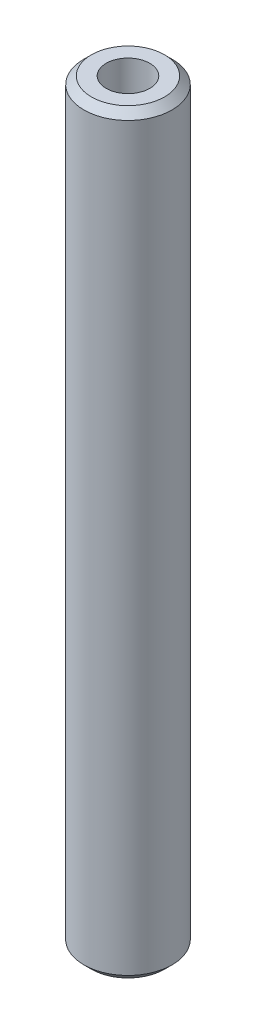
ISO-10303-21;
HEADER;
FILE_DESCRIPTION(('STEP AP214'),'2;1');
FILE_NAME('part.step','',(''),(''),'','','');
FILE_SCHEMA(('AUTOMOTIVE_DESIGN { 1 0 10303 214 1 1 1 1 }'));
ENDSEC;
DATA;
#1=APPLICATION_CONTEXT('core data for automotive mechanical design processes');
#2=APPLICATION_PROTOCOL_DEFINITION('international standard','automotive_design',2000,#1);
#3=PRODUCT_CONTEXT('',#1,'mechanical');
#4=PRODUCT('Part','Part','',(#3));
#5=PRODUCT_RELATED_PRODUCT_CATEGORY('part','',(#4));
#6=PRODUCT_DEFINITION_FORMATION('','',#4);
#7=PRODUCT_DEFINITION_CONTEXT('part definition',#1,'design');
#8=PRODUCT_DEFINITION('design','',#6,#7);
#9=PRODUCT_DEFINITION_SHAPE('','',#8);
#10=(LENGTH_UNIT() NAMED_UNIT(*) SI_UNIT(.MILLI.,.METRE.));
#11=(NAMED_UNIT(*) PLANE_ANGLE_UNIT() SI_UNIT($,.RADIAN.));
#12=(NAMED_UNIT(*) SI_UNIT($,.STERADIAN.) SOLID_ANGLE_UNIT());
#13=UNCERTAINTY_MEASURE_WITH_UNIT(LENGTH_MEASURE(1.E-05),#10,'distance_accuracy_value','');
#14=(GEOMETRIC_REPRESENTATION_CONTEXT(3) GLOBAL_UNCERTAINTY_ASSIGNED_CONTEXT((#13)) GLOBAL_UNIT_ASSIGNED_CONTEXT((#10,
#11,#12)) REPRESENTATION_CONTEXT('',''));
#15=CARTESIAN_POINT('',(0.,0.,0.));
#16=DIRECTION('',(0.,0.,1.));
#17=DIRECTION('',(1.,0.,0.));
#18=AXIS2_PLACEMENT_3D('',#15,#16,#17);
#19=CARTESIAN_POINT('',(0.,600.,0.));
#20=DIRECTION('',(0.,-1.,0.));
#21=DIRECTION('',(0.,0.,-1.));
#22=AXIS2_PLACEMENT_3D('',#19,#20,#21);
#23=CYLINDRICAL_SURFACE('',#22,35.);
#24=CARTESIAN_POINT('',(0.,594.026457167701,0.));
#25=DIRECTION('',(0.,1.,0.));
#26=DIRECTION('',(0.,0.,1.));
#27=AXIS2_PLACEMENT_3D('',#24,#25,#26);
#28=CIRCLE('',#27,35.);
#29=CARTESIAN_POINT('',(0.,594.026457167701,35.));
#30=VERTEX_POINT('',#29);
#31=EDGE_CURVE('E50',#30,#30,#28,.F.);
#32=ORIENTED_EDGE('',*,*,#31,.T.);
#33=EDGE_LOOP('',(#32));
#34=FACE_BOUND('',#33,.T.);
#35=CARTESIAN_POINT('',(0.,5.97354283229934,0.));
#36=DIRECTION('',(0.,1.,0.));
#37=DIRECTION('',(0.,0.,1.));
#38=AXIS2_PLACEMENT_3D('',#35,#36,#37);
#39=CIRCLE('',#38,35.);
#40=CARTESIAN_POINT('',(0.,5.97354283229934,35.));
#41=VERTEX_POINT('',#40);
#42=EDGE_CURVE('E51',#41,#41,#39,.T.);
#43=ORIENTED_EDGE('',*,*,#42,.T.);
#44=EDGE_LOOP('',(#43));
#45=FACE_BOUND('',#44,.T.);
#46=ADVANCED_FACE('F39',(#34,#45),#23,.T.);
#47=CARTESIAN_POINT('',(0.,600.,0.));
#48=DIRECTION('',(0.,1.,0.));
#49=DIRECTION('',(0.,0.,1.));
#50=AXIS2_PLACEMENT_3D('',#47,#48,#49);
#51=PLANE('',#50);
#52=CARTESIAN_POINT('',(0.,600.,0.));
#53=DIRECTION('',(0.,1.,0.));
#54=DIRECTION('',(0.,0.,1.));
#55=AXIS2_PLACEMENT_3D('',#52,#53,#54);
#56=CIRCLE('',#55,29.0264571677008);
#57=CARTESIAN_POINT('',(0.,600.,29.0264571677008));
#58=VERTEX_POINT('',#57);
#59=EDGE_CURVE('E54',#58,#58,#56,.T.);
#60=ORIENTED_EDGE('',*,*,#59,.T.);
#61=EDGE_LOOP('',(#60));
#62=FACE_BOUND('',#61,.T.);
#63=CARTESIAN_POINT('',(0.,600.,0.));
#64=DIRECTION('',(0.,1.,0.));
#65=DIRECTION('',(0.,0.,1.));
#66=AXIS2_PLACEMENT_3D('',#63,#64,#65);
#67=CIRCLE('',#66,17.3092760052108);
#68=CARTESIAN_POINT('',(0.,600.,17.3092760052108));
#69=VERTEX_POINT('',#68);
#70=EDGE_CURVE('E58',#69,#69,#67,.T.);
#71=ORIENTED_EDGE('',*,*,#70,.F.);
#72=EDGE_LOOP('',(#71));
#73=FACE_BOUND('',#72,.T.);
#74=ADVANCED_FACE('F69',(#62,#73),#51,.T.);
#75=CARTESIAN_POINT('',(0.,0.,0.));
#76=DIRECTION('',(0.,1.,0.));
#77=DIRECTION('',(0.,0.,1.));
#78=AXIS2_PLACEMENT_3D('',#75,#76,#77);
#79=PLANE('',#78);
#80=CARTESIAN_POINT('',(0.,0.,0.));
#81=DIRECTION('',(0.,1.,0.));
#82=DIRECTION('',(0.,0.,1.));
#83=AXIS2_PLACEMENT_3D('',#80,#81,#82);
#84=CIRCLE('',#83,29.0264571677006);
#85=CARTESIAN_POINT('',(0.,0.,29.0264571677006));
#86=VERTEX_POINT('',#85);
#87=EDGE_CURVE('E10',#86,#86,#84,.F.);
#88=ORIENTED_EDGE('',*,*,#87,.T.);
#89=EDGE_LOOP('',(#88));
#90=FACE_BOUND('',#89,.T.);
#91=CARTESIAN_POINT('',(0.,0.,0.));
#92=DIRECTION('',(0.,1.,0.));
#93=DIRECTION('',(0.,0.,1.));
#94=AXIS2_PLACEMENT_3D('',#91,#92,#93);
#95=CIRCLE('',#94,17.3092760052108);
#96=CARTESIAN_POINT('',(0.,0.,17.3092760052108));
#97=VERTEX_POINT('',#96);
#98=EDGE_CURVE('E63',#97,#97,#95,.T.);
#99=ORIENTED_EDGE('',*,*,#98,.T.);
#100=EDGE_LOOP('',(#99));
#101=FACE_BOUND('',#100,.T.);
#102=ADVANCED_FACE('F75',(#90,#101),#79,.F.);
#103=CARTESIAN_POINT('',(0.,600.,0.));
#104=DIRECTION('',(0.,-1.,0.));
#105=DIRECTION('',(0.,0.,-1.));
#106=AXIS2_PLACEMENT_3D('',#103,#104,#105);
#107=CYLINDRICAL_SURFACE('',#106,17.3092760052108);
#108=ORIENTED_EDGE('',*,*,#70,.T.);
#109=EDGE_LOOP('',(#108));
#110=FACE_BOUND('',#109,.T.);
#111=ORIENTED_EDGE('',*,*,#98,.F.);
#112=EDGE_LOOP('',(#111));
#113=FACE_BOUND('',#112,.T.);
#114=ADVANCED_FACE('F70',(#110,#113),#107,.F.);
#115=CARTESIAN_POINT('',(0.,600.,0.));
#116=DIRECTION('',(0.,-1.,0.));
#117=DIRECTION('',(0.,0.,-1.));
#118=AXIS2_PLACEMENT_3D('',#115,#116,#117);
#119=CONICAL_SURFACE('',#118,29.0264571677008,0.785398163397447);
#120=ORIENTED_EDGE('',*,*,#31,.F.);
#121=EDGE_LOOP('',(#120));
#122=FACE_BOUND('',#121,.T.);
#123=ORIENTED_EDGE('',*,*,#59,.F.);
#124=EDGE_LOOP('',(#123));
#125=FACE_BOUND('',#124,.T.);
#126=ADVANCED_FACE('F81',(#122,#125),#119,.T.);
#127=CARTESIAN_POINT('',(0.,5.97354283229934,0.));
#128=DIRECTION('',(0.,1.,0.));
#129=DIRECTION('',(0.,0.,1.));
#130=AXIS2_PLACEMENT_3D('',#127,#128,#129);
#131=CONICAL_SURFACE('',#130,35.,0.785398163397456);
#132=ORIENTED_EDGE('',*,*,#87,.F.);
#133=EDGE_LOOP('',(#132));
#134=FACE_BOUND('',#133,.T.);
#135=ORIENTED_EDGE('',*,*,#42,.F.);
#136=EDGE_LOOP('',(#135));
#137=FACE_BOUND('',#136,.T.);
#138=ADVANCED_FACE('F45',(#134,#137),#131,.T.);
#139=CLOSED_SHELL('',(#46,#74,#102,#114,#126,#138));
#140=MANIFOLD_SOLID_BREP('B2',#139);
#141=ADVANCED_BREP_SHAPE_REPRESENTATION('',(#18,#140),#14);
#142=SHAPE_DEFINITION_REPRESENTATION(#9,#141);
ENDSEC;
END-ISO-10303-21;
